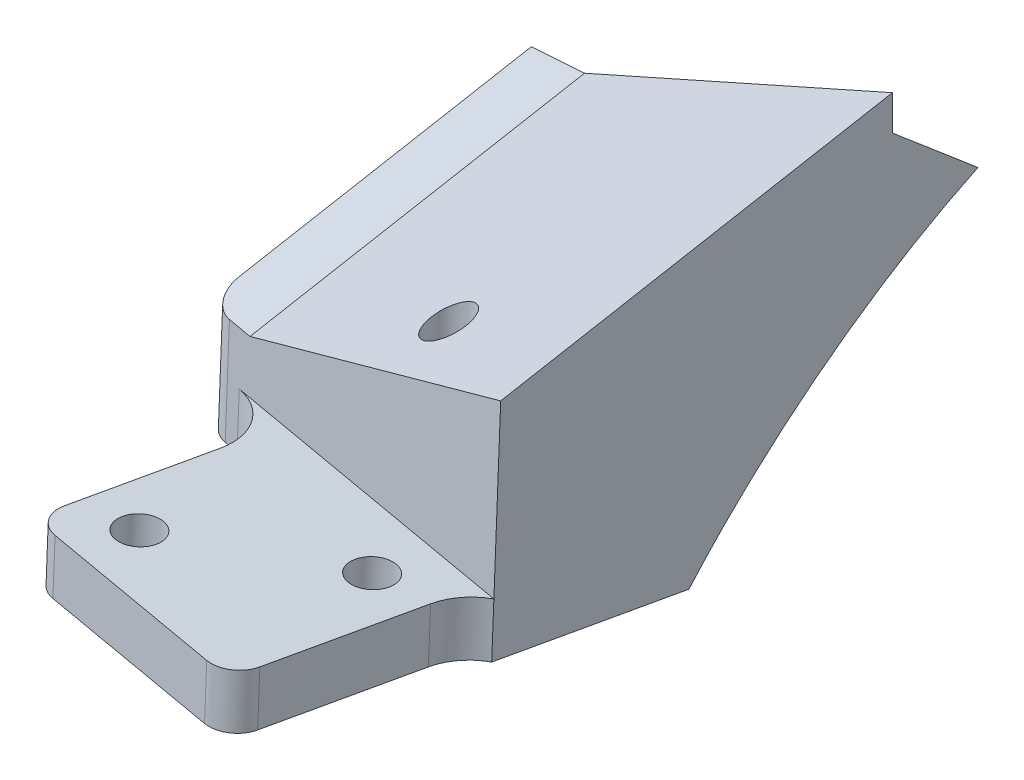
ISO-10303-21;
HEADER;
FILE_DESCRIPTION(('STEP AP214'),'2;1');
FILE_NAME('part.step','',(''),(''),'','','');
FILE_SCHEMA(('AUTOMOTIVE_DESIGN { 1 0 10303 214 1 1 1 1 }'));
ENDSEC;
DATA;
#1=APPLICATION_CONTEXT('core data for automotive mechanical design processes');
#2=APPLICATION_PROTOCOL_DEFINITION('international standard','automotive_design',2000,#1);
#3=PRODUCT_CONTEXT('',#1,'mechanical');
#4=PRODUCT('Part','Part','',(#3));
#5=PRODUCT_RELATED_PRODUCT_CATEGORY('part','',(#4));
#6=PRODUCT_DEFINITION_FORMATION('','',#4);
#7=PRODUCT_DEFINITION_CONTEXT('part definition',#1,'design');
#8=PRODUCT_DEFINITION('design','',#6,#7);
#9=PRODUCT_DEFINITION_SHAPE('','',#8);
#10=(LENGTH_UNIT() NAMED_UNIT(*) SI_UNIT(.MILLI.,.METRE.));
#11=(NAMED_UNIT(*) PLANE_ANGLE_UNIT() SI_UNIT($,.RADIAN.));
#12=(NAMED_UNIT(*) SI_UNIT($,.STERADIAN.) SOLID_ANGLE_UNIT());
#13=UNCERTAINTY_MEASURE_WITH_UNIT(LENGTH_MEASURE(1.E-05),#10,'distance_accuracy_value','');
#14=(GEOMETRIC_REPRESENTATION_CONTEXT(3) GLOBAL_UNCERTAINTY_ASSIGNED_CONTEXT((#13)) GLOBAL_UNIT_ASSIGNED_CONTEXT((#10,
#11,#12)) REPRESENTATION_CONTEXT('',''));
#15=CARTESIAN_POINT('',(0.,0.,0.));
#16=DIRECTION('',(0.,0.,1.));
#17=DIRECTION('',(1.,0.,0.));
#18=AXIS2_PLACEMENT_3D('',#15,#16,#17);
#19=CARTESIAN_POINT('',(824.732085834627,5821.44498100306,18.9934864671472));
#20=DIRECTION('',(-0.00606023370630814,-0.999390827085141,0.0343692930608406));
#21=DIRECTION('',(0.,0.0343699242089877,0.999409179620574));
#22=AXIS2_PLACEMENT_3D('',#19,#20,#21);
#23=PLANE('',#22);
#24=CARTESIAN_POINT('',(838.819100795339,5821.1208398731,12.0520265814064));
#25=DIRECTION('',(-0.00606023370630814,-0.999390827085141,0.0343692930608406));
#26=DIRECTION('',(-0.462317085890736,-0.0276760183058803,-0.88628265813127));
#27=AXIS2_PLACEMENT_3D('',#24,#25,#26);
#28=ELLIPSE('',#27,3.48633872282764,2.52729999999997);
#29=CARTESIAN_POINT('',(837.207306836573,5821.02435189878,8.9621450309927));
#30=VERTEX_POINT('',#29);
#31=EDGE_CURVE('E328',#30,#30,#28,.T.);
#32=ORIENTED_EDGE('',*,*,#31,.F.);
#33=EDGE_LOOP('',(#32));
#34=FACE_BOUND('',#33,.T.);
#35=DIRECTION('',(-0.394397487112533,0.0339725620847751,0.918311759254293));
#36=VECTOR('',#35,1.);
#37=CARTESIAN_POINT('',(821.226521874585,5820.95180967383,4.0349175322677));
#38=LINE('',#37,#36);
#39=CARTESIAN_POINT('',(823.135376170953,5820.78738501795,-0.409642598910876));
#40=VERTEX_POINT('',#39);
#41=CARTESIAN_POINT('',(821.371793384874,5820.9392962944,3.69666858154716));
#42=VERTEX_POINT('',#41);
#43=EDGE_CURVE('E218',#40,#42,#38,.T.);
#44=ORIENTED_EDGE('',*,*,#43,.F.);
#45=DIRECTION('',(0.984807753010193,-3.09363076460256E-11,0.17364817767836));
#46=VECTOR('',#45,1.);
#47=CARTESIAN_POINT('',(859.669425506688,5820.78738501681,6.03229601399774));
#48=LINE('',#47,#46);
#49=CARTESIAN_POINT('',(838.636761234494,5820.78738501747,2.32366982637515));
#50=VERTEX_POINT('',#49);
#51=EDGE_CURVE('E291',#40,#50,#48,.T.);
#52=ORIENTED_EDGE('',*,*,#51,.T.);
#53=CARTESIAN_POINT('',(838.836445724791,5820.85675702432,4.37607986175295));
#54=DIRECTION('',(-0.00606023370630814,-0.999390827085141,0.0343692930608406));
#55=DIRECTION('',(-0.462317085890736,-0.0276760183058803,-0.88628265813127));
#56=AXIS2_PLACEMENT_3D('',#53,#54,#55);
#57=ELLIPSE('',#56,2.18991125805627,1.58749999999905);
#58=CARTESIAN_POINT('',(840.32308241607,5820.82814107145,3.80611890873291));
#59=VERTEX_POINT('',#58);
#60=EDGE_CURVE('E66',#50,#59,#57,.T.);
#61=ORIENTED_EDGE('',*,*,#60,.T.);
#62=CARTESIAN_POINT('',(862.622632785247,5820.3989017783,-4.74329538659908));
#63=DIRECTION('',(-0.00606023370630814,-0.999390827085141,0.0343692930608406));
#64=DIRECTION('',(-0.462317085890736,-0.0276760183058803,-0.88628265813127));
#65=AXIS2_PLACEMENT_3D('',#62,#63,#64);
#66=ELLIPSE('',#65,32.8486688708639,23.8125);
#67=CARTESIAN_POINT('',(860.135504626068,5821.41636155642,24.4038677292095));
#68=VERTEX_POINT('',#67);
#69=EDGE_CURVE('E54',#59,#68,#66,.F.);
#70=ORIENTED_EDGE('',*,*,#69,.T.);
#71=DIRECTION('',(0.173542395900398,-0.0348994948111996,-0.984207834802727));
#72=VECTOR('',#71,1.);
#73=CARTESIAN_POINT('',(856.654669511219,5822.11635988478,44.1446646331368));
#74=LINE('',#73,#72);
#75=CARTESIAN_POINT('',(856.654669511219,5822.11635988478,44.1446646331368));
#76=VERTEX_POINT('',#75);
#77=EDGE_CURVE('E262',#76,#68,#74,.T.);
#78=ORIENTED_EDGE('',*,*,#77,.F.);
#79=CARTESIAN_POINT('',(859.845174788359,5822.28573508757,49.6323315327014));
#80=DIRECTION('',(0.00606023370630814,0.999390827085141,-0.0343692930608406));
#81=DIRECTION('',(0.,0.0343699242089877,0.999409179620574));
#82=AXIS2_PLACEMENT_3D('',#79,#80,#81);
#83=CIRCLE('',#82,6.35);
#84=CARTESIAN_POINT('',(853.591645556733,5822.28573508801,48.5296656045025));
#85=VERTEX_POINT('',#84);
#86=EDGE_CURVE('E234',#85,#76,#83,.F.);
#87=ORIENTED_EDGE('',*,*,#86,.F.);
#88=DIRECTION('',(0.173542395900156,-0.0348994948112074,-0.98420783480277));
#89=VECTOR('',#88,1.);
#90=CARTESIAN_POINT('',(850.025909509087,5823.00280705217,68.7519596250967));
#91=LINE('',#90,#89);
#92=CARTESIAN_POINT('',(850.576906616351,5822.89200115609,65.6270997480084));
#93=VERTEX_POINT('',#92);
#94=EDGE_CURVE('E251',#93,#85,#91,.T.);
#95=ORIENTED_EDGE('',*,*,#94,.F.);
#96=CARTESIAN_POINT('',(847.450142000536,5822.89200115595,65.0757667839216));
#97=DIRECTION('',(0.00606023370630814,0.999390827085141,-0.0343692930608406));
#98=DIRECTION('',(0.,0.0343699242089877,0.999409179620574));
#99=AXIS2_PLACEMENT_3D('',#96,#97,#98);
#100=CIRCLE('',#99,3.175);
#101=CARTESIAN_POINT('',(846.899144891964,5823.00280705219,68.2006266591323));
#102=VERTEX_POINT('',#101);
#103=EDGE_CURVE('E225',#102,#93,#100,.T.);
#104=ORIENTED_EDGE('',*,*,#103,.F.);
#105=DIRECTION('',(0.984807752923825,-6.26330527505035E-12,0.173648178168175));
#106=VECTOR('',#105,1.);
#107=CARTESIAN_POINT('',(822.095449303528,5823.00280705235,63.8270658925945));
#108=LINE('',#107,#106);
#109=CARTESIAN_POINT('',(825.222213917472,5823.00280705233,64.3783988579982));
#110=VERTEX_POINT('',#109);
#111=EDGE_CURVE('E257',#110,#102,#108,.T.);
#112=ORIENTED_EDGE('',*,*,#111,.F.);
#113=CARTESIAN_POINT('',(825.773211026045,5822.89200115624,61.2535389827819));
#114=DIRECTION('',(0.00606023370630814,0.999390827085141,-0.0343692930608406));
#115=DIRECTION('',(0.,0.0343699242089877,0.999409179620574));
#116=AXIS2_PLACEMENT_3D('',#113,#114,#115);
#117=CIRCLE('',#116,3.175);
#118=CARTESIAN_POINT('',(822.646446410232,5822.89200115638,60.7022060186847));
#119=VERTEX_POINT('',#118);
#120=EDGE_CURVE('E348',#119,#110,#117,.T.);
#121=ORIENTED_EDGE('',*,*,#120,.F.);
#122=DIRECTION('',(-0.173542395900381,0.034899494811193,0.984207834802731));
#123=VECTOR('',#122,1.);
#124=CARTESIAN_POINT('',(826.503426152613,5822.11635988551,38.8281869270818));
#125=LINE('',#124,#123);
#126=CARTESIAN_POINT('',(825.401431940732,5822.33797167714,45.0779066662515));
#127=VERTEX_POINT('',#126);
#128=EDGE_CURVE('E275',#127,#119,#125,.T.);
#129=ORIENTED_EDGE('',*,*,#128,.F.);
#130=CARTESIAN_POINT('',(819.147902709105,5822.3379716773,43.9752407380609));
#131=DIRECTION('',(0.00606023370630814,0.999390827085141,-0.0343692930608406));
#132=DIRECTION('',(0.,0.0343699242089877,0.999409179620574));
#133=AXIS2_PLACEMENT_3D('',#130,#131,#132);
#134=CIRCLE('',#133,6.35);
#135=CARTESIAN_POINT('',(820.249896991847,5822.11635987143,37.7255205970252));
#136=VERTEX_POINT('',#135);
#137=EDGE_CURVE('E227',#136,#127,#134,.F.);
#138=ORIENTED_EDGE('',*,*,#137,.F.);
#139=DIRECTION('',(0.984807741852991,2.21277309512399E-09,0.173648240953985));
#140=VECTOR('',#139,1.);
#141=CARTESIAN_POINT('',(815.435727924869,5822.11635986061,36.8766523818313));
#142=LINE('',#141,#140);
#143=CARTESIAN_POINT('',(818.562405221485,5822.11635986763,37.4279701563714));
#144=VERTEX_POINT('',#143);
#145=EDGE_CURVE('E189',#144,#136,#142,.T.);
#146=ORIENTED_EDGE('',*,*,#145,.F.);
#147=CARTESIAN_POINT('',(819.113402240573,5822.00555398928,34.3031107793532));
#148=DIRECTION('',(0.00606023370630814,0.999390827085141,-0.0343692930608406));
#149=DIRECTION('',(0.,0.0343699242089877,0.999409179620574));
#150=AXIS2_PLACEMENT_3D('',#147,#148,#149);
#151=CIRCLE('',#150,3.175);
#152=CARTESIAN_POINT('',(815.986637618731,5822.00555299508,33.7517778494515));
#153=VERTEX_POINT('',#152);
#154=EDGE_CURVE('E358',#153,#144,#151,.T.);
#155=ORIENTED_EDGE('',*,*,#154,.F.);
#156=DIRECTION('',(-0.173542394001316,0.0348998079770558,0.984207824032839));
#157=VECTOR('',#156,1.);
#158=CARTESIAN_POINT('',(815.435640641101,5822.11635986061,36.8766369913481));
#159=LINE('',#158,#157);
#160=CARTESIAN_POINT('',(816.438342989376,5821.91471573083,31.1900293930887));
#161=VERTEX_POINT('',#160);
#162=EDGE_CURVE('E210',#161,#153,#159,.T.);
#163=ORIENTED_EDGE('',*,*,#162,.F.);
#164=DIRECTION('',(-0.173542395900339,0.0348994948112006,0.984207834802738));
#165=VECTOR('',#164,1.);
#166=CARTESIAN_POINT('',(832.201860924864,5818.74466146517,-58.2093232876828));
#167=LINE('',#166,#165);
#168=CARTESIAN_POINT('',(821.162599646967,5820.96466447762,4.39743849967588));
#169=VERTEX_POINT('',#168);
#170=EDGE_CURVE('E215',#169,#161,#167,.T.);
#171=ORIENTED_EDGE('',*,*,#170,.F.);
#172=CARTESIAN_POINT('',(824.289364262781,5820.96466447753,4.94877146377141));
#173=DIRECTION('',(0.00606023370630814,0.999390827085141,-0.0343692930608406));
#174=DIRECTION('',(0.,0.0343699242089877,0.999409179620574));
#175=AXIS2_PLACEMENT_3D('',#172,#173,#174);
#176=CIRCLE('',#175,3.175);
#177=EDGE_CURVE('E361',#42,#169,#176,.T.);
#178=ORIENTED_EDGE('',*,*,#177,.F.);
#179=EDGE_LOOP('',(#44,#52,#61,#70,#78,#87,#95,#104,#112,#121,#129,#138,#146,#155,#163,#171,#178));
#180=FACE_BOUND('',#179,.T.);
#181=CARTESIAN_POINT('',(829.450972748561,5822.78119526018,58.6800120729679));
#182=DIRECTION('',(0.00606023370630815,0.999390827085141,-0.0343692930608406));
#183=DIRECTION('',(0.,0.0343699242089877,0.999409179620574));
#184=AXIS2_PLACEMENT_3D('',#181,#182,#183);
#185=CIRCLE('',#184,2.45744999999995);
#186=CARTESIAN_POINT('',(829.450972748561,5822.86565763043,61.1360101614264));
#187=VERTEX_POINT('',#186);
#188=EDGE_CURVE('E304',#187,#187,#185,.T.);
#189=ORIENTED_EDGE('',*,*,#188,.T.);
#190=EDGE_LOOP('',(#189));
#191=FACE_BOUND('',#190,.T.);
#192=CARTESIAN_POINT('',(847.078362669451,5822.33797172624,48.9001358612131));
#193=DIRECTION('',(0.00606023370630815,0.999390827085141,-0.0343692930608406));
#194=DIRECTION('',(0.,0.0343699242089877,0.999409179620574));
#195=AXIS2_PLACEMENT_3D('',#192,#193,#194);
#196=CIRCLE('',#195,2.45744999999995);
#197=CARTESIAN_POINT('',(847.078362669451,5822.42243409648,51.3561339496716));
#198=VERTEX_POINT('',#197);
#199=EDGE_CURVE('E299',#198,#198,#196,.T.);
#200=ORIENTED_EDGE('',*,*,#199,.T.);
#201=EDGE_LOOP('',(#200));
#202=FACE_BOUND('',#201,.T.);
#203=CARTESIAN_POINT('',(841.570650488862,5821.89474809187,35.040914006106));
#204=DIRECTION('',(0.00606023370630815,0.999390827085141,-0.0343692930608406));
#205=DIRECTION('',(0.,0.0343699242089877,0.999409179620574));
#206=AXIS2_PLACEMENT_3D('',#203,#204,#205);
#207=CIRCLE('',#206,2.45744999999995);
#208=CARTESIAN_POINT('',(841.570650488862,5821.97921046212,37.4969120945646));
#209=VERTEX_POINT('',#208);
#210=EDGE_CURVE('E293',#209,#209,#207,.T.);
#211=ORIENTED_EDGE('',*,*,#210,.T.);
#212=EDGE_LOOP('',(#211));
#213=FACE_BOUND('',#212,.T.);
#214=ADVANCED_FACE('F36',(#34,#180,#191,#202,#213),#23,.T.);
#215=CARTESIAN_POINT('',(821.73528087452,5904.85106214043,1.14960188051162));
#216=DIRECTION('',(-0.918919961545479,-0.00798997894069778,-0.394363112511532));
#217=DIRECTION('',(0.394375701138189,0.,-0.918949294766453));
#218=AXIS2_PLACEMENT_3D('',#215,#216,#217);
#219=PLANE('',#218);
#220=DIRECTION('',(0.246216324644758,0.769476460634136,-0.589307642923788));
#221=VECTOR('',#220,1.);
#222=CARTESIAN_POINT('',(838.7507650414,5869.58867460261,-37.7843699727308));
#223=LINE('',#222,#221);
#224=CARTESIAN_POINT('',(826.585949048063,5831.57113223078,-8.66843279846676));
#225=VERTEX_POINT('',#224);
#226=EDGE_CURVE('E325',#40,#225,#223,.T.);
#227=ORIENTED_EDGE('',*,*,#226,.F.);
#228=ORIENTED_EDGE('',*,*,#43,.T.);
#229=DIRECTION('',(-0.00606023365258398,-0.999390827089769,0.0343692929357497));
#230=VECTOR('',#229,1.);
#231=CARTESIAN_POINT('',(821.371793384874,5820.93929629445,3.69666858154542));
#232=LINE('',#231,#230);
#233=CARTESIAN_POINT('',(821.486485041997,5839.85305385615,3.04621987165795));
#234=VERTEX_POINT('',#233);
#235=EDGE_CURVE('E367',#234,#42,#232,.T.);
#236=ORIENTED_EDGE('',*,*,#235,.F.);
#237=DIRECTION('',(-0.334920499749828,0.543936642431572,0.769390140219897));
#238=VECTOR('',#237,1.);
#239=CARTESIAN_POINT('',(810.162075274232,5858.24476601232,29.0610180868656));
#240=LINE('',#239,#238);
#241=EDGE_CURVE('E256',#225,#234,#240,.T.);
#242=ORIENTED_EDGE('',*,*,#241,.F.);
#243=EDGE_LOOP('',(#227,#228,#236,#242));
#244=FACE_BOUND('',#243,.T.);
#245=ADVANCED_FACE('F416',(#244),#219,.T.);
#246=CARTESIAN_POINT('',(806.847681514202,5809.38781094641,85.5813734553546));
#247=DIRECTION('',(0.984807753012215,-1.37745668311619E-13,0.173648177666893));
#248=DIRECTION('',(-0.173648177666893,0.,0.984807753012215));
#249=AXIS2_PLACEMENT_3D('',#246,#247,#248);
#250=PLANE('',#249);
#251=ORIENTED_EDGE('',*,*,#170,.T.);
#252=ORIENTED_EDGE('',*,*,#162,.T.);
#253=DIRECTION('',(-0.00606023367558917,-0.999390827085143,0.0343692930662186));
#254=VECTOR('',#253,1.);
#255=CARTESIAN_POINT('',(815.899086717089,5807.56756715369,34.2483036862117));
#256=LINE('',#255,#254);
#257=CARTESIAN_POINT('',(816.069722640328,5835.70707225937,33.280579276997));
#258=VERTEX_POINT('',#257);
#259=EDGE_CURVE('E353',#258,#153,#256,.T.);
#260=ORIENTED_EDGE('',*,*,#259,.F.);
#261=DIRECTION('',(-0.162114539766769,-0.358367949545289,0.91939724207489));
#262=VECTOR('',#261,1.);
#263=CARTESIAN_POINT('',(806.502984955835,5814.5589866357,87.5362447801086));
#264=LINE('',#263,#262);
#265=CARTESIAN_POINT('',(821.226521874589,5847.10661464747,4.03491753231538));
#266=VERTEX_POINT('',#265);
#267=EDGE_CURVE('E183',#266,#258,#264,.T.);
#268=ORIENTED_EDGE('',*,*,#267,.F.);
#269=DIRECTION('',(-1.39870617275604E-13,-1.,0.));
#270=VECTOR('',#269,1.);
#271=CARTESIAN_POINT('',(821.226521874589,5847.52345795996,4.03491753231544));
#272=LINE('',#271,#270);
#273=CARTESIAN_POINT('',(821.226521874588,5840.62791193934,4.03491753231544));
#274=VERTEX_POINT('',#273);
#275=EDGE_CURVE('E181',#266,#274,#272,.T.);
#276=ORIENTED_EDGE('',*,*,#275,.T.);
#277=DIRECTION('',(-0.134949979968397,0.629320391056686,0.765339368062815));
#278=VECTOR('',#277,1.);
#279=CARTESIAN_POINT('',(816.079524872091,5864.63021388503,33.2249880658916));
#280=LINE('',#279,#278);
#281=CARTESIAN_POINT('',(821.280314980698,5840.37705530198,3.72984167105106));
#282=VERTEX_POINT('',#281);
#283=EDGE_CURVE('E390',#282,#274,#280,.T.);
#284=ORIENTED_EDGE('',*,*,#283,.F.);
#285=DIRECTION('',(-0.00606023365258398,-0.999390827089769,0.0343692929357498));
#286=VECTOR('',#285,1.);
#287=CARTESIAN_POINT('',(821.278632886759,5840.09966192704,3.73938129639041));
#288=LINE('',#287,#286);
#289=EDGE_CURVE('E354',#169,#282,#288,.F.);
#290=ORIENTED_EDGE('',*,*,#289,.F.);
#291=EDGE_LOOP('',(#251,#252,#260,#268,#276,#284,#290));
#292=FACE_BOUND('',#291,.T.);
#293=ADVANCED_FACE('F397',(#292),#250,.F.);
#294=CARTESIAN_POINT('',(-0.711464825880899,-1.57275338283267,4.03491753231544));
#295=DIRECTION('',(0.,0.,1.));
#296=DIRECTION('',(-1.,0.,0.));
#297=AXIS2_PLACEMENT_3D('',#294,#295,#296);
#298=PLANE('',#297);
#299=DIRECTION('',(-0.913545457642889,-0.406736643075152,0.));
#300=VECTOR('',#299,1.);
#301=CARTESIAN_POINT('',(861.14432243096,5862.51175722371,4.03491753231544));
#302=LINE('',#301,#300);
#303=CARTESIAN_POINT('',(863.727100114488,5863.66168393618,4.03491753231544));
#304=VERTEX_POINT('',#303);
#305=CARTESIAN_POINT('',(827.480051106216,5847.52345795996,4.03491753231577));
#306=VERTEX_POINT('',#305);
#307=EDGE_CURVE('E179',#304,#306,#302,.T.);
#308=ORIENTED_EDGE('',*,*,#307,.F.);
#309=DIRECTION('',(-5.29916329728926E-11,-1.,0.));
#310=VECTOR('',#309,1.);
#311=CARTESIAN_POINT('',(863.727100112485,5818.94933417387,4.03491753231544));
#312=LINE('',#311,#310);
#313=CARTESIAN_POINT('',(863.727100114564,5859.55038851364,4.0349175323028));
#314=VERTEX_POINT('',#313);
#315=EDGE_CURVE('E194',#304,#314,#312,.T.);
#316=ORIENTED_EDGE('',*,*,#315,.T.);
#317=DIRECTION('',(0.913545457642691,0.406736643075598,0.));
#318=VECTOR('',#317,1.);
#319=CARTESIAN_POINT('',(-2035.53500010733,4568.71573526781,4.03491753231544));
#320=LINE('',#319,#318);
#321=EDGE_CURVE('E205',#274,#314,#320,.T.);
#322=ORIENTED_EDGE('',*,*,#321,.F.);
#323=ORIENTED_EDGE('',*,*,#275,.F.);
#324=DIRECTION('',(-0.997785778769943,-0.0665096961687352,0.));
#325=VECTOR('',#324,1.);
#326=CARTESIAN_POINT('',(-385.208158754962,5766.6889480868,4.03491753231544));
#327=LINE('',#326,#325);
#328=EDGE_CURVE('E165',#306,#266,#327,.T.);
#329=ORIENTED_EDGE('',*,*,#328,.F.);
#330=EDGE_LOOP('',(#308,#316,#322,#323,#329));
#331=FACE_BOUND('',#330,.T.);
#332=ADVANCED_FACE('F177',(#331),#298,.F.);
#333=CARTESIAN_POINT('',(813.101210745852,5815.73781094641,85.5813734553546));
#334=DIRECTION('',(0.391225810938873,-0.878707558270885,-0.27352402434309));
#335=DIRECTION('',(0.913545457642889,0.406736643075152,0.));
#336=AXIS2_PLACEMENT_3D('',#333,#334,#335);
#337=PLANE('',#336);
#338=CARTESIAN_POINT('',(841.70741039537,5844.44777206768,34.2653100387438));
#339=DIRECTION('',(-0.391225810938873,0.878707558270885,0.27352402434309));
#340=DIRECTION('',(-0.690935587901324,-0.476776362710872,0.543408054165231));
#341=AXIS2_PLACEMENT_3D('',#338,#339,#340);
#342=ELLIPSE('',#341,2.83639024401117,2.45744999999995);
#343=CARTESIAN_POINT('',(839.747647434607,5843.09544824391,35.8066273420952));
#344=VERTEX_POINT('',#343);
#345=EDGE_CURVE('E308',#344,#344,#342,.T.);
#346=ORIENTED_EDGE('',*,*,#345,.F.);
#347=EDGE_LOOP('',(#346));
#348=FACE_BOUND('',#347,.T.);
#349=DIRECTION('',(0.162114539766769,0.358367949545303,-0.919397242074885));
#350=VECTOR('',#349,1.);
#351=CARTESIAN_POINT('',(813.101210745852,5815.73781094641,85.5813734553546));
#352=LINE('',#351,#350);
#353=CARTESIAN_POINT('',(821.57552036301,5834.47099160795,37.5211753897621));
#354=VERTEX_POINT('',#353);
#355=EDGE_CURVE('E161',#354,#306,#352,.T.);
#356=ORIENTED_EDGE('',*,*,#355,.F.);
#357=DIRECTION('',(-0.91974172493257,-0.363020444838897,-0.149302766374339));
#358=VECTOR('',#357,1.);
#359=CARTESIAN_POINT('',(814.751788010703,5831.77767642299,36.4134708140323));
#360=LINE('',#359,#358);
#361=CARTESIAN_POINT('',(856.813927471259,5848.37952905624,43.2414678597368));
#362=VERTEX_POINT('',#361);
#363=EDGE_CURVE('E200',#362,#354,#360,.T.);
#364=ORIENTED_EDGE('',*,*,#363,.F.);
#365=DIRECTION('',(0.162114539766769,0.358367949545303,-0.919397242074884));
#366=VECTOR('',#365,1.);
#367=CARTESIAN_POINT('',(866.563044983366,5869.93078076825,-12.0485250439907));
#368=LINE('',#367,#366);
#369=EDGE_CURVE('E187',#362,#304,#368,.T.);
#370=ORIENTED_EDGE('',*,*,#369,.T.);
#371=ORIENTED_EDGE('',*,*,#307,.T.);
#372=EDGE_LOOP('',(#356,#364,#370,#371));
#373=FACE_BOUND('',#372,.T.);
#374=ADVANCED_FACE('F185',(#348,#373),#337,.F.);
#375=CARTESIAN_POINT('',(867.351469080837,6164.49539327973,33.8902176263409));
#376=DIRECTION('',(0.173542395900381,-0.0348994948111627,-0.984207834802732));
#377=DIRECTION('',(-0.00606023367545488,-0.999390827085143,0.0343692930662423));
#378=AXIS2_PLACEMENT_3D('',#375,#376,#377);
#379=PLANE('',#378);
#380=ORIENTED_EDGE('',*,*,#145,.T.);
#381=DIRECTION('',(0.00606023367545487,0.999390827085143,-0.0343692930662423));
#382=VECTOR('',#381,1.);
#383=CARTESIAN_POINT('',(820.249896923071,5822.11635988509,37.7255209870692));
#384=LINE('',#383,#382);
#385=CARTESIAN_POINT('',(820.288379406912,5828.46249163724,37.507275976093));
#386=VERTEX_POINT('',#385);
#387=EDGE_CURVE('E211',#386,#136,#384,.F.);
#388=ORIENTED_EDGE('',*,*,#387,.F.);
#389=DIRECTION('',(0.984807753012018,-3.13034511506549E-11,0.173648177668007));
#390=VECTOR('',#389,1.);
#391=CARTESIAN_POINT('',(865.31378986488,5828.46249163581,45.4464706573567));
#392=LINE('',#391,#390);
#393=CARTESIAN_POINT('',(856.693151997142,5828.46249163609,43.9264196103476));
#394=VERTEX_POINT('',#393);
#395=EDGE_CURVE('E192',#386,#394,#392,.T.);
#396=ORIENTED_EDGE('',*,*,#395,.T.);
#397=DIRECTION('',(-0.00606023367545335,-0.999390827085143,0.0343692930662426));
#398=VECTOR('',#397,1.);
#399=CARTESIAN_POINT('',(857.17200594306,5907.43011346267,41.2107039326103));
#400=LINE('',#399,#398);
#401=EDGE_CURVE('E198',#362,#394,#400,.T.);
#402=ORIENTED_EDGE('',*,*,#401,.F.);
#403=ORIENTED_EDGE('',*,*,#363,.T.);
#404=DIRECTION('',(0.984807753012208,0.,0.173648177666931));
#405=VECTOR('',#404,1.);
#406=CARTESIAN_POINT('',(865.350224984392,5834.47099160795,45.2398368870553));
#407=LINE('',#406,#405);
#408=CARTESIAN_POINT('',(818.637322726573,5834.47099160795,37.0030918718045));
#409=VERTEX_POINT('',#408);
#410=EDGE_CURVE('E169',#409,#354,#407,.T.);
#411=ORIENTED_EDGE('',*,*,#410,.F.);
#412=DIRECTION('',(-0.00606023367558917,-0.999390827085143,0.0343692930662186));
#413=VECTOR('',#412,1.);
#414=CARTESIAN_POINT('',(820.63856682305,6164.49539327974,25.6534726110957));
#415=LINE('',#414,#413);
#416=EDGE_CURVE('E355',#144,#409,#415,.F.);
#417=ORIENTED_EDGE('',*,*,#416,.F.);
#418=EDGE_LOOP('',(#380,#388,#396,#402,#403,#411,#417));
#419=FACE_BOUND('',#418,.T.);
#420=ADVANCED_FACE('F281',(#419),#379,.F.);
#421=CARTESIAN_POINT('',(857.17200594306,5907.43011346267,41.2107039326103));
#422=DIRECTION('',(0.984807753012206,0.,0.173648177666944));
#423=DIRECTION('',(-0.173648177666944,0.,0.984807753012206));
#424=AXIS2_PLACEMENT_3D('',#421,#422,#423);
#425=PLANE('',#424);
#426=CARTESIAN_POINT('',(864.577537469682,5816.00811396758,-0.788152378920916));
#427=DIRECTION('',(0.984807753012206,0.,0.173648177666944));
#428=DIRECTION('',(0.109280339074445,0.777145961456999,-0.619759600234519));
#429=AXIS2_PLACEMENT_3D('',#426,#427,#428);
#430=ELLIPSE('',#429,56.7455269365032,23.8125);
#431=CARTESIAN_POINT('',(865.238098391799,5852.50405899442,-4.53437953433672));
#432=VERTEX_POINT('',#431);
#433=EDGE_CURVE('E201',#68,#432,#430,.F.);
#434=ORIENTED_EDGE('',*,*,#433,.T.);
#435=DIRECTION('',(0.134949979930567,-0.629320391069814,-0.765339368058691));
#436=VECTOR('',#435,1.);
#437=CARTESIAN_POINT('',(861.597482201222,5869.48156433357,16.1125808881413));
#438=LINE('',#437,#436);
#439=EDGE_CURVE('E214',#314,#432,#438,.T.);
#440=ORIENTED_EDGE('',*,*,#439,.F.);
#441=ORIENTED_EDGE('',*,*,#315,.F.);
#442=ORIENTED_EDGE('',*,*,#369,.F.);
#443=ORIENTED_EDGE('',*,*,#401,.T.);
#444=EDGE_CURVE('E266',#394,#76,#400,.T.);
#445=ORIENTED_EDGE('',*,*,#444,.T.);
#446=ORIENTED_EDGE('',*,*,#77,.T.);
#447=EDGE_LOOP('',(#434,#440,#441,#442,#443,#445,#446));
#448=FACE_BOUND('',#447,.T.);
#449=ADVANCED_FACE('F287',(#448),#425,.T.);
#450=CARTESIAN_POINT('',(824.770568320552,5827.79111275463,18.775241444349));
#451=DIRECTION('',(-0.00606023370630814,-0.999390827085141,0.0343692930608406));
#452=DIRECTION('',(0.,0.0343699242089877,0.999409179620574));
#453=AXIS2_PLACEMENT_3D('',#450,#451,#452);
#454=PLANE('',#453);
#455=CARTESIAN_POINT('',(829.489455232596,5829.12732701217,58.4617670620317));
#456=DIRECTION('',(0.00606023370630814,0.999390827085141,-0.0343692930608406));
#457=DIRECTION('',(0.,0.0343699242089877,0.999409179620574));
#458=AXIS2_PLACEMENT_3D('',#455,#456,#457);
#459=CIRCLE('',#458,2.45744999999999);
#460=CARTESIAN_POINT('',(829.489455232596,5829.21178938241,60.9177651504902));
#461=VERTEX_POINT('',#460);
#462=EDGE_CURVE('E312',#461,#461,#459,.T.);
#463=ORIENTED_EDGE('',*,*,#462,.F.);
#464=EDGE_LOOP('',(#463));
#465=FACE_BOUND('',#464,.T.);
#466=CARTESIAN_POINT('',(847.116845153486,5828.68410347822,48.6818908502769));
#467=DIRECTION('',(0.00606023370630814,0.999390827085141,-0.0343692930608406));
#468=DIRECTION('',(0.,0.0343699242089877,0.999409179620574));
#469=AXIS2_PLACEMENT_3D('',#466,#467,#468);
#470=CIRCLE('',#469,2.45744999999999);
#471=CARTESIAN_POINT('',(847.116845153486,5828.76856584847,51.1378889387354));
#472=VERTEX_POINT('',#471);
#473=EDGE_CURVE('E310',#472,#472,#470,.T.);
#474=ORIENTED_EDGE('',*,*,#473,.F.);
#475=EDGE_LOOP('',(#474));
#476=FACE_BOUND('',#475,.T.);
#477=DIRECTION('',(0.984807752923825,-6.26330527505035E-12,0.173648178168175));
#478=VECTOR('',#477,1.);
#479=CARTESIAN_POINT('',(822.133931789453,5829.34893880392,63.6088208697964));
#480=LINE('',#479,#478);
#481=CARTESIAN_POINT('',(825.260696403396,5829.3489388039,64.1601538352));
#482=VERTEX_POINT('',#481);
#483=CARTESIAN_POINT('',(846.937627377888,5829.34893880376,67.9823816363342));
#484=VERTEX_POINT('',#483);
#485=EDGE_CURVE('E265',#482,#484,#480,.T.);
#486=ORIENTED_EDGE('',*,*,#485,.T.);
#487=CARTESIAN_POINT('',(847.488624486461,5829.23813290752,64.8575217611234));
#488=DIRECTION('',(0.00606023370630814,0.999390827085141,-0.0343692930608406));
#489=DIRECTION('',(0.,0.0343699242089877,0.999409179620574));
#490=AXIS2_PLACEMENT_3D('',#487,#488,#489);
#491=CIRCLE('',#490,3.175);
#492=CARTESIAN_POINT('',(850.615389102275,5829.23813290766,65.4088547252103));
#493=VERTEX_POINT('',#492);
#494=EDGE_CURVE('E338',#493,#484,#491,.F.);
#495=ORIENTED_EDGE('',*,*,#494,.F.);
#496=DIRECTION('',(0.173542395900156,-0.0348994948112074,-0.98420783480277));
#497=VECTOR('',#496,1.);
#498=CARTESIAN_POINT('',(850.064391995012,5829.34893880374,68.5337146022986));
#499=LINE('',#498,#497);
#500=CARTESIAN_POINT('',(853.630128040572,5828.63186684,48.3114205935319));
#501=VERTEX_POINT('',#500);
#502=EDGE_CURVE('E269',#493,#501,#499,.T.);
#503=ORIENTED_EDGE('',*,*,#502,.T.);
#504=CARTESIAN_POINT('',(859.883657272198,5828.63186683956,49.4140865217308));
#505=DIRECTION('',(0.00606023370630814,0.999390827085141,-0.0343692930608406));
#506=DIRECTION('',(0.,0.0343699242089877,0.999409179620574));
#507=AXIS2_PLACEMENT_3D('',#504,#505,#506);
#508=CIRCLE('',#507,6.35);
#509=EDGE_CURVE('E237',#394,#501,#508,.T.);
#510=ORIENTED_EDGE('',*,*,#509,.F.);
#511=ORIENTED_EDGE('',*,*,#395,.F.);
#512=CARTESIAN_POINT('',(819.186385192944,5828.68410342929,43.7569957270903));
#513=DIRECTION('',(0.00606023370630814,0.999390827085141,-0.0343692930608406));
#514=DIRECTION('',(0.,0.0343699242089877,0.999409179620574));
#515=AXIS2_PLACEMENT_3D('',#512,#513,#514);
#516=CIRCLE('',#515,6.35);
#517=CARTESIAN_POINT('',(825.439914424571,5828.68410342913,44.8596616552808));
#518=VERTEX_POINT('',#517);
#519=EDGE_CURVE('E232',#518,#386,#516,.T.);
#520=ORIENTED_EDGE('',*,*,#519,.F.);
#521=DIRECTION('',(-0.173542395900381,0.034899494811193,0.984207834802731));
#522=VECTOR('',#521,1.);
#523=CARTESIAN_POINT('',(826.541908638538,5828.46249163708,38.6099419042837));
#524=LINE('',#523,#522);
#525=CARTESIAN_POINT('',(822.684928896156,5829.23813290795,60.4839609958866));
#526=VERTEX_POINT('',#525);
#527=EDGE_CURVE('E273',#518,#526,#524,.T.);
#528=ORIENTED_EDGE('',*,*,#527,.T.);
#529=CARTESIAN_POINT('',(825.811693511969,5829.23813290782,61.0352939599838));
#530=DIRECTION('',(0.00606023370630814,0.999390827085141,-0.0343692930608406));
#531=DIRECTION('',(0.,0.0343699242089877,0.999409179620574));
#532=AXIS2_PLACEMENT_3D('',#529,#530,#531);
#533=CIRCLE('',#532,3.175);
#534=EDGE_CURVE('E341',#482,#526,#533,.F.);
#535=ORIENTED_EDGE('',*,*,#534,.F.);
#536=EDGE_LOOP('',(#486,#495,#503,#510,#511,#520,#528,#535));
#537=FACE_BOUND('',#536,.T.);
#538=ADVANCED_FACE('F285',(#465,#476,#537),#454,.F.);
#539=CARTESIAN_POINT('',(826.503426152613,5822.11635988551,38.8281869270818));
#540=DIRECTION('',(0.984807753012208,0.,0.173648177666931));
#541=DIRECTION('',(-0.173648177666931,0.,0.984807753012208));
#542=AXIS2_PLACEMENT_3D('',#539,#540,#541);
#543=PLANE('',#542);
#544=ORIENTED_EDGE('',*,*,#527,.F.);
#545=DIRECTION('',(0.00606023367545488,0.999390827085143,-0.0343692930662423));
#546=VECTOR('',#545,1.);
#547=CARTESIAN_POINT('',(825.439914424571,5828.6841034292,44.8596616552787));
#548=LINE('',#547,#546);
#549=EDGE_CURVE('E230',#127,#518,#548,.T.);
#550=ORIENTED_EDGE('',*,*,#549,.F.);
#551=ORIENTED_EDGE('',*,*,#128,.T.);
#552=DIRECTION('',(0.00606023400388092,0.999390827019096,-0.034369294928839));
#553=VECTOR('',#552,1.);
#554=CARTESIAN_POINT('',(822.646446410487,5822.89200119842,60.7022060172391));
#555=LINE('',#554,#553);
#556=EDGE_CURVE('E339',#526,#119,#555,.F.);
#557=ORIENTED_EDGE('',*,*,#556,.F.);
#558=EDGE_LOOP('',(#544,#550,#551,#557));
#559=FACE_BOUND('',#558,.T.);
#560=ADVANCED_FACE('F407',(#559),#543,.F.);
#561=CARTESIAN_POINT('',(822.095449303528,5823.00280705235,63.8270658925945));
#562=DIRECTION('',(0.173542396389637,-0.0348994967024928,-0.984207834649397));
#563=DIRECTION('',(0.984807752923863,0.,0.17364817816796));
#564=AXIS2_PLACEMENT_3D('',#561,#562,#563);
#565=PLANE('',#564);
#566=ORIENTED_EDGE('',*,*,#111,.T.);
#567=DIRECTION('',(0.00606023400388092,0.999390827019096,-0.0343692949288389));
#568=VECTOR('',#567,1.);
#569=CARTESIAN_POINT('',(846.899144891967,5823.0028070528,68.2006266591115));
#570=LINE('',#569,#568);
#571=EDGE_CURVE('E79',#484,#102,#570,.F.);
#572=ORIENTED_EDGE('',*,*,#571,.F.);
#573=ORIENTED_EDGE('',*,*,#485,.F.);
#574=DIRECTION('',(0.00606023400388091,0.999390827019096,-0.0343692949288389));
#575=VECTOR('',#574,1.);
#576=CARTESIAN_POINT('',(825.222213917472,5823.00280705241,64.3783988579955));
#577=LINE('',#576,#575);
#578=EDGE_CURVE('E344',#110,#482,#577,.T.);
#579=ORIENTED_EDGE('',*,*,#578,.F.);
#580=EDGE_LOOP('',(#566,#572,#573,#579));
#581=FACE_BOUND('',#580,.T.);
#582=ADVANCED_FACE('F460',(#581),#565,.F.);
#583=CARTESIAN_POINT('',(850.025909509087,5823.00280705217,68.7519596250967));
#584=DIRECTION('',(-0.984807753012248,0.,-0.173648177666705));
#585=DIRECTION('',(0.173648177666705,0.,-0.984807753012248));
#586=AXIS2_PLACEMENT_3D('',#583,#584,#585);
#587=PLANE('',#586);
#588=ORIENTED_EDGE('',*,*,#94,.T.);
#589=DIRECTION('',(0.00606023367545488,0.999390827085143,-0.0343692930662423));
#590=VECTOR('',#589,1.);
#591=CARTESIAN_POINT('',(853.591645556733,5822.28573508801,48.5296656045025));
#592=LINE('',#591,#590);
#593=EDGE_CURVE('E231',#501,#85,#592,.F.);
#594=ORIENTED_EDGE('',*,*,#593,.F.);
#595=ORIENTED_EDGE('',*,*,#502,.F.);
#596=DIRECTION('',(0.00606023400388092,0.999390827019096,-0.034369294928839));
#597=VECTOR('',#596,1.);
#598=CARTESIAN_POINT('',(850.576906616314,5822.89200115009,65.6270997482149));
#599=LINE('',#598,#597);
#600=EDGE_CURVE('E253',#93,#493,#599,.T.);
#601=ORIENTED_EDGE('',*,*,#600,.F.);
#602=EDGE_LOOP('',(#588,#594,#595,#601));
#603=FACE_BOUND('',#602,.T.);
#604=ADVANCED_FACE('F252',(#603),#587,.F.);
#605=CARTESIAN_POINT('',(892.876516322818,5776.20883910597,-102.894057915364));
#606=DIRECTION('',(-0.314068466301227,0.705409324836672,-0.635420083809656));
#607=DIRECTION('',(0.939760342521629,0.326118889122343,-0.102454715758886));
#608=AXIS2_PLACEMENT_3D('',#605,#606,#607);
#609=PLANE('',#608);
#610=CARTESIAN_POINT('',(831.162118835801,5838.31870293135,-3.43950039600099));
#611=DIRECTION('',(-0.314068466301226,0.70540932483667,-0.635420083809655));
#612=DIRECTION('',(0.,0.669285715990173,0.743005134821773));
#613=AXIS2_PLACEMENT_3D('',#610,#611,#612);
#614=CIRCLE('',#613,2.99720000000029);
#615=CARTESIAN_POINT('',(831.162118835801,5840.32468607931,-1.21256540591296));
#616=VERTEX_POINT('',#615);
#617=EDGE_CURVE('E692',#616,#616,#614,.T.);
#618=ORIENTED_EDGE('',*,*,#617,.F.);
#619=EDGE_LOOP('',(#618));
#620=FACE_BOUND('',#619,.T.);
#621=DIRECTION('',(0.939760342519577,0.326118889123203,-0.102454715774997));
#622=VECTOR('',#621,1.);
#623=CARTESIAN_POINT('',(832.82851577842,5833.73744935997,-9.34901099597862));
#624=LINE('',#623,#622);
#625=CARTESIAN_POINT('',(832.865332718624,5833.75022570208,-9.35302485884737));
#626=VERTEX_POINT('',#625);
#627=EDGE_CURVE('E316',#225,#626,#624,.T.);
#628=ORIENTED_EDGE('',*,*,#627,.F.);
#629=ORIENTED_EDGE('',*,*,#241,.T.);
#630=CARTESIAN_POINT('',(824.418217904371,5842.21386951241,4.21800614884211));
#631=DIRECTION('',(0.314068466301227,-0.705409324836672,0.635420083809656));
#632=DIRECTION('',(0.339315211451099,0.708481243004554,0.618804909150387));
#633=AXIS2_PLACEMENT_3D('',#630,#631,#632);
#634=ELLIPSE('',#633,4.37982251647373,3.175);
#635=EDGE_CURVE('E364',#282,#234,#634,.T.);
#636=ORIENTED_EDGE('',*,*,#635,.F.);
#637=ORIENTED_EDGE('',*,*,#283,.T.);
#638=ORIENTED_EDGE('',*,*,#321,.T.);
#639=ORIENTED_EDGE('',*,*,#439,.T.);
#640=CARTESIAN_POINT('',(855.809516439311,5835.70141163617,-18.5275221525782));
#641=DIRECTION('',(-0.314068466301226,0.70540932483667,-0.635420083809655));
#642=DIRECTION('',(0.,0.669285715990173,0.743005134821774));
#643=AXIS2_PLACEMENT_3D('',#640,#641,#642);
#644=CIRCLE('',#643,23.8125);
#645=CARTESIAN_POINT('',(834.098500676275,5834.80878056121,-8.78739070832824));
#646=VERTEX_POINT('',#645);
#647=EDGE_CURVE('E11',#646,#432,#644,.T.);
#648=ORIENTED_EDGE('',*,*,#647,.F.);
#649=CARTESIAN_POINT('',(832.651099625407,5834.74927182287,-8.13804861204614));
#650=DIRECTION('',(0.314068466301226,-0.70540932483667,0.635420083809655));
#651=DIRECTION('',(0.,0.669285715990173,0.743005134821774));
#652=AXIS2_PLACEMENT_3D('',#649,#650,#651);
#653=CIRCLE('',#652,1.58749999999905);
#654=EDGE_CURVE('E320',#626,#646,#653,.T.);
#655=ORIENTED_EDGE('',*,*,#654,.F.);
#656=EDGE_LOOP('',(#628,#629,#636,#637,#638,#639,#648,#655));
#657=FACE_BOUND('',#656,.T.);
#658=ADVANCED_FACE('F387',(#620,#657),#609,.T.);
#659=CARTESIAN_POINT('',(-5.33646381398883,4020.3358239735,4690.60388510827));
#660=DIRECTION('',(0.0622299413727401,-0.933580426497206,-0.352923535143295));
#661=DIRECTION('',(0.16211453976677,0.35836794954529,-0.91939724207489));
#662=AXIS2_PLACEMENT_3D('',#659,#660,#661);
#663=PLANE('',#662);
#664=ORIENTED_EDGE('',*,*,#410,.T.);
#665=ORIENTED_EDGE('',*,*,#355,.T.);
#666=ORIENTED_EDGE('',*,*,#328,.T.);
#667=ORIENTED_EDGE('',*,*,#267,.T.);
#668=CARTESIAN_POINT('',(819.196487256142,5835.70707225937,33.8319122410894));
#669=DIRECTION('',(-0.0622299413727401,0.933580426497206,0.352923535143295));
#670=DIRECTION('',(-0.162114539767019,-0.358367949545289,0.919397242074846));
#671=AXIS2_PLACEMENT_3D('',#668,#669,#670);
#672=ELLIPSE('',#671,3.44919419549101,3.175);
#673=EDGE_CURVE('E350',#409,#258,#672,.F.);
#674=ORIENTED_EDGE('',*,*,#673,.F.);
#675=EDGE_LOOP('',(#664,#665,#666,#667,#674));
#676=FACE_BOUND('',#675,.T.);
#677=ADVANCED_FACE('F163',(#676),#663,.F.);
#678=CARTESIAN_POINT('',(861.921336477781,6164.66476848334,37.8578334888912));
#679=DIRECTION('',(0.00606023367545335,0.999390827085143,-0.0343692930662426));
#680=DIRECTION('',(0.,-0.0343699242143833,-0.999409179620388));
#681=AXIS2_PLACEMENT_3D('',#678,#679,#680);
#682=CYLINDRICAL_SURFACE('',#681,6.35);
#683=ORIENTED_EDGE('',*,*,#86,.T.);
#684=ORIENTED_EDGE('',*,*,#444,.F.);
#685=ORIENTED_EDGE('',*,*,#509,.T.);
#686=ORIENTED_EDGE('',*,*,#593,.T.);
#687=EDGE_LOOP('',(#683,#684,#685,#686));
#688=FACE_BOUND('',#687,.T.);
#689=ADVANCED_FACE('F242',(#688),#682,.F.);
#690=CARTESIAN_POINT('',(819.147902709104,5822.33797167714,43.9752407380665));
#691=DIRECTION('',(-0.00606023367545488,-0.999390827085143,0.0343692930662423));
#692=DIRECTION('',(0.,0.034369924214383,0.999409179620388));
#693=AXIS2_PLACEMENT_3D('',#690,#691,#692);
#694=CYLINDRICAL_SURFACE('',#693,6.35);
#695=ORIENTED_EDGE('',*,*,#137,.T.);
#696=ORIENTED_EDGE('',*,*,#549,.T.);
#697=ORIENTED_EDGE('',*,*,#519,.T.);
#698=ORIENTED_EDGE('',*,*,#387,.T.);
#699=EDGE_LOOP('',(#695,#696,#697,#698));
#700=FACE_BOUND('',#699,.T.);
#701=ADVANCED_FACE('F404',(#700),#694,.F.);
#702=CARTESIAN_POINT('',(824.798123258206,5904.86391694458,2.06345582251492));
#703=DIRECTION('',(0.00606023365258398,0.999390827089769,-0.0343692929357498));
#704=DIRECTION('',(0.,-0.0343699240838833,-0.999409179624876));
#705=AXIS2_PLACEMENT_3D('',#702,#703,#704);
#706=CYLINDRICAL_SURFACE('',#705,3.175);
#707=ORIENTED_EDGE('',*,*,#635,.T.);
#708=ORIENTED_EDGE('',*,*,#235,.T.);
#709=ORIENTED_EDGE('',*,*,#177,.T.);
#710=ORIENTED_EDGE('',*,*,#289,.T.);
#711=EDGE_LOOP('',(#707,#708,#709,#710));
#712=FACE_BOUND('',#711,.T.);
#713=ADVANCED_FACE('F419',(#712),#706,.T.);
#714=CARTESIAN_POINT('',(819.025851332903,5807.56756715369,34.799636650304));
#715=DIRECTION('',(-0.00606023367558917,-0.999390827085143,0.0343692930662186));
#716=DIRECTION('',(0.,0.0343699242143594,0.999409179620389));
#717=AXIS2_PLACEMENT_3D('',#714,#715,#716);
#718=CYLINDRICAL_SURFACE('',#717,3.175);
#719=ORIENTED_EDGE('',*,*,#673,.T.);
#720=ORIENTED_EDGE('',*,*,#259,.T.);
#721=ORIENTED_EDGE('',*,*,#154,.T.);
#722=ORIENTED_EDGE('',*,*,#416,.T.);
#723=EDGE_LOOP('',(#719,#720,#721,#722));
#724=FACE_BOUND('',#723,.T.);
#725=ADVANCED_FACE('F399',(#724),#718,.T.);
#726=CARTESIAN_POINT('',(825.773211026009,5822.89200115038,61.2535389829837));
#727=DIRECTION('',(0.00606023400388091,0.999390827019096,-0.0343692949288389));
#728=DIRECTION('',(0.,-0.0343699260770823,-0.99940917955633));
#729=AXIS2_PLACEMENT_3D('',#726,#727,#728);
#730=CYLINDRICAL_SURFACE('',#729,3.175);
#731=ORIENTED_EDGE('',*,*,#120,.T.);
#732=ORIENTED_EDGE('',*,*,#578,.T.);
#733=ORIENTED_EDGE('',*,*,#534,.T.);
#734=ORIENTED_EDGE('',*,*,#556,.T.);
#735=EDGE_LOOP('',(#731,#732,#733,#734));
#736=FACE_BOUND('',#735,.T.);
#737=ADVANCED_FACE('F375',(#736),#730,.T.);
#738=CARTESIAN_POINT('',(847.4501420005,5822.89200115009,65.0757667841231));
#739=DIRECTION('',(0.00606023400388092,0.999390827019096,-0.0343692949288389));
#740=DIRECTION('',(0.,-0.0343699260770823,-0.99940917955633));
#741=AXIS2_PLACEMENT_3D('',#738,#739,#740);
#742=CYLINDRICAL_SURFACE('',#741,3.175);
#743=ORIENTED_EDGE('',*,*,#103,.T.);
#744=ORIENTED_EDGE('',*,*,#600,.T.);
#745=ORIENTED_EDGE('',*,*,#494,.T.);
#746=ORIENTED_EDGE('',*,*,#571,.T.);
#747=EDGE_LOOP('',(#743,#744,#745,#746));
#748=FACE_BOUND('',#747,.T.);
#749=ADVANCED_FACE('F481',(#748),#742,.T.);
#750=CARTESIAN_POINT('',(841.570650488862,5821.89474809187,35.040914006106));
#751=DIRECTION('',(-0.00606023370630815,-0.999390827085141,0.0343692930608406));
#752=DIRECTION('',(0.,0.0343699242089877,0.999409179620574));
#753=AXIS2_PLACEMENT_3D('',#750,#751,#752);
#754=CYLINDRICAL_SURFACE('',#753,2.45744999999995);
#755=ORIENTED_EDGE('',*,*,#345,.T.);
#756=EDGE_LOOP('',(#755));
#757=FACE_BOUND('',#756,.T.);
#758=ORIENTED_EDGE('',*,*,#210,.F.);
#759=EDGE_LOOP('',(#758));
#760=FACE_BOUND('',#759,.T.);
#761=ADVANCED_FACE('F477',(#757,#760),#754,.F.);
#762=CARTESIAN_POINT('',(847.078362669451,5822.33797172624,48.9001358612131));
#763=DIRECTION('',(-0.00606023370630815,-0.999390827085141,0.0343692930608406));
#764=DIRECTION('',(0.,0.0343699242089877,0.999409179620574));
#765=AXIS2_PLACEMENT_3D('',#762,#763,#764);
#766=CYLINDRICAL_SURFACE('',#765,2.45744999999999);
#767=ORIENTED_EDGE('',*,*,#473,.T.);
#768=EDGE_LOOP('',(#767));
#769=FACE_BOUND('',#768,.T.);
#770=ORIENTED_EDGE('',*,*,#199,.F.);
#771=EDGE_LOOP('',(#770));
#772=FACE_BOUND('',#771,.T.);
#773=ADVANCED_FACE('F480',(#769,#772),#766,.F.);
#774=CARTESIAN_POINT('',(829.450972748561,5822.78119526018,58.6800120729679));
#775=DIRECTION('',(-0.00606023370630815,-0.999390827085141,0.0343692930608406));
#776=DIRECTION('',(0.,0.0343699242089877,0.999409179620574));
#777=AXIS2_PLACEMENT_3D('',#774,#775,#776);
#778=CYLINDRICAL_SURFACE('',#777,2.45744999999999);
#779=ORIENTED_EDGE('',*,*,#462,.T.);
#780=EDGE_LOOP('',(#779));
#781=FACE_BOUND('',#780,.T.);
#782=ORIENTED_EDGE('',*,*,#188,.F.);
#783=EDGE_LOOP('',(#782));
#784=FACE_BOUND('',#783,.T.);
#785=ADVANCED_FACE('F485',(#781,#784),#778,.F.);
#786=CARTESIAN_POINT('',(854.610865625079,5784.81349058229,34.7208146956605));
#787=DIRECTION('',(-0.134949979977404,0.629320391053561,0.765339368063797));
#788=DIRECTION('',(0.,-0.772405010660809,0.635130301202892));
#789=AXIS2_PLACEMENT_3D('',#786,#787,#788);
#790=PLANE('',#789);
#791=ORIENTED_EDGE('',*,*,#51,.F.);
#792=ORIENTED_EDGE('',*,*,#226,.T.);
#793=ORIENTED_EDGE('',*,*,#627,.T.);
#794=DIRECTION('',(-0.314068466301226,0.70540932483667,-0.635420083809655));
#795=VECTOR('',#794,1.);
#796=CARTESIAN_POINT('',(854.647682565284,5784.82626692441,34.7168008327917));
#797=LINE('',#796,#795);
#798=EDGE_CURVE('E70',#50,#626,#797,.T.);
#799=ORIENTED_EDGE('',*,*,#798,.F.);
#800=EDGE_LOOP('',(#791,#792,#793,#799));
#801=FACE_BOUND('',#800,.T.);
#802=ADVANCED_FACE('F423',(#801),#790,.F.);
#803=CARTESIAN_POINT('',(854.433449472066,5785.8253130452,35.9317770795929));
#804=DIRECTION('',(-0.314068466301226,0.70540932483667,-0.635420083809655));
#805=DIRECTION('',(0.,0.669285715990173,0.743005134821773));
#806=AXIS2_PLACEMENT_3D('',#803,#804,#805);
#807=CYLINDRICAL_SURFACE('',#806,1.58749999999905);
#808=ORIENTED_EDGE('',*,*,#798,.T.);
#809=ORIENTED_EDGE('',*,*,#654,.T.);
#810=DIRECTION('',(-0.314068466301226,0.70540932483667,-0.635420083809655));
#811=VECTOR('',#810,1.);
#812=CARTESIAN_POINT('',(855.880850522935,5785.88482178353,35.2824349833108));
#813=LINE('',#812,#811);
#814=EDGE_CURVE('E45',#59,#646,#813,.T.);
#815=ORIENTED_EDGE('',*,*,#814,.F.);
#816=ORIENTED_EDGE('',*,*,#60,.F.);
#817=EDGE_LOOP('',(#808,#809,#815,#816));
#818=FACE_BOUND('',#817,.T.);
#819=ADVANCED_FACE('F424',(#818),#807,.T.);
#820=CARTESIAN_POINT('',(877.59186628597,5786.77745285849,25.5423035390608));
#821=DIRECTION('',(-0.314068466301226,0.70540932483667,-0.635420083809655));
#822=DIRECTION('',(0.,0.669285715990173,0.743005134821773));
#823=AXIS2_PLACEMENT_3D('',#820,#821,#822);
#824=CYLINDRICAL_SURFACE('',#823,23.8125);
#825=ORIENTED_EDGE('',*,*,#814,.T.);
#826=ORIENTED_EDGE('',*,*,#647,.T.);
#827=ORIENTED_EDGE('',*,*,#433,.F.);
#828=ORIENTED_EDGE('',*,*,#69,.F.);
#829=EDGE_LOOP('',(#825,#826,#827,#828));
#830=FACE_BOUND('',#829,.T.);
#831=ADVANCED_FACE('F425',(#830),#824,.F.);
#832=CARTESIAN_POINT('',(831.162118835802,5838.31870293135,-3.43950039600082));
#833=DIRECTION('',(-0.314068466301226,0.70540932483667,-0.635420083809655));
#834=DIRECTION('',(0.,0.669285715990173,0.743005134821773));
#835=AXIS2_PLACEMENT_3D('',#832,#833,#834);
#836=CYLINDRICAL_SURFACE('',#835,2.52729999999997);
#837=CARTESIAN_POINT('',(832.637926558951,5835.00398451394,-0.453661422179112));
#838=DIRECTION('',(0.314068466301226,-0.70540932483667,0.635420083809655));
#839=DIRECTION('',(0.,-0.669285715990173,-0.743005134821773));
#840=AXIS2_PLACEMENT_3D('',#837,#838,#839);
#841=CIRCLE('',#840,2.52729999999997);
#842=CARTESIAN_POINT('',(832.637926558951,5833.31249872392,-2.33145829941416));
#843=VERTEX_POINT('',#842);
#844=EDGE_CURVE('E39',#843,#843,#841,.F.);
#845=ORIENTED_EDGE('',*,*,#844,.T.);
#846=EDGE_LOOP('',(#845));
#847=FACE_BOUND('',#846,.T.);
#848=ORIENTED_EDGE('',*,*,#31,.T.);
#849=EDGE_LOOP('',(#848));
#850=FACE_BOUND('',#849,.T.);
#851=ADVANCED_FACE('F427',(#847,#850),#836,.F.);
#852=CARTESIAN_POINT('',(832.637926558951,5835.00398451394,-0.453661422179099));
#853=DIRECTION('',(0.314068466301226,-0.70540932483667,0.635420083809655));
#854=DIRECTION('',(0.,-0.669285715990173,-0.743005134821773));
#855=AXIS2_PLACEMENT_3D('',#852,#853,#854);
#856=PLANE('',#855);
#857=CARTESIAN_POINT('',(832.637926558951,5835.00398451394,-0.453661422179197));
#858=DIRECTION('',(-0.314068466301226,0.70540932483667,-0.635420083809655));
#859=DIRECTION('',(0.,0.669285715990173,0.743005134821773));
#860=AXIS2_PLACEMENT_3D('',#857,#858,#859);
#861=CIRCLE('',#860,2.87019999999996);
#862=CARTESIAN_POINT('',(832.637926558951,5836.92496837597,1.67891191578622));
#863=VERTEX_POINT('',#862);
#864=EDGE_CURVE('E689',#863,#863,#861,.T.);
#865=ORIENTED_EDGE('',*,*,#864,.T.);
#866=EDGE_LOOP('',(#865));
#867=FACE_BOUND('',#866,.T.);
#868=ORIENTED_EDGE('',*,*,#844,.F.);
#869=EDGE_LOOP('',(#868));
#870=FACE_BOUND('',#869,.T.);
#871=ADVANCED_FACE('F433',(#867,#870),#856,.F.);
#872=CARTESIAN_POINT('',(831.162118835801,5838.31870293135,-3.43950039600099));
#873=DIRECTION('',(-0.314068466301226,0.70540932483667,-0.635420083809655));
#874=DIRECTION('',(0.,0.669285715990173,0.743005134821773));
#875=AXIS2_PLACEMENT_3D('',#872,#873,#874);
#876=CONICAL_SURFACE('',#875,2.99720000000043,0.027020449187326);
#877=ORIENTED_EDGE('',*,*,#864,.F.);
#878=EDGE_LOOP('',(#877));
#879=FACE_BOUND('',#878,.T.);
#880=ORIENTED_EDGE('',*,*,#617,.T.);
#881=EDGE_LOOP('',(#880));
#882=FACE_BOUND('',#881,.T.);
#883=ADVANCED_FACE('F667',(#879,#882),#876,.F.);
#884=CLOSED_SHELL('',(#214,#245,#293,#332,#374,#420,#449,#538,#560,#582,#604,#658,#677,#689,
#701,#713,#725,#737,#749,#761,#773,#785,#802,#819,#831,#851,#871,#883));
#885=MANIFOLD_SOLID_BREP('B2',#884);
#886=ADVANCED_BREP_SHAPE_REPRESENTATION('',(#18,#885),#14);
#887=SHAPE_DEFINITION_REPRESENTATION(#9,#886);
ENDSEC;
END-ISO-10303-21;
